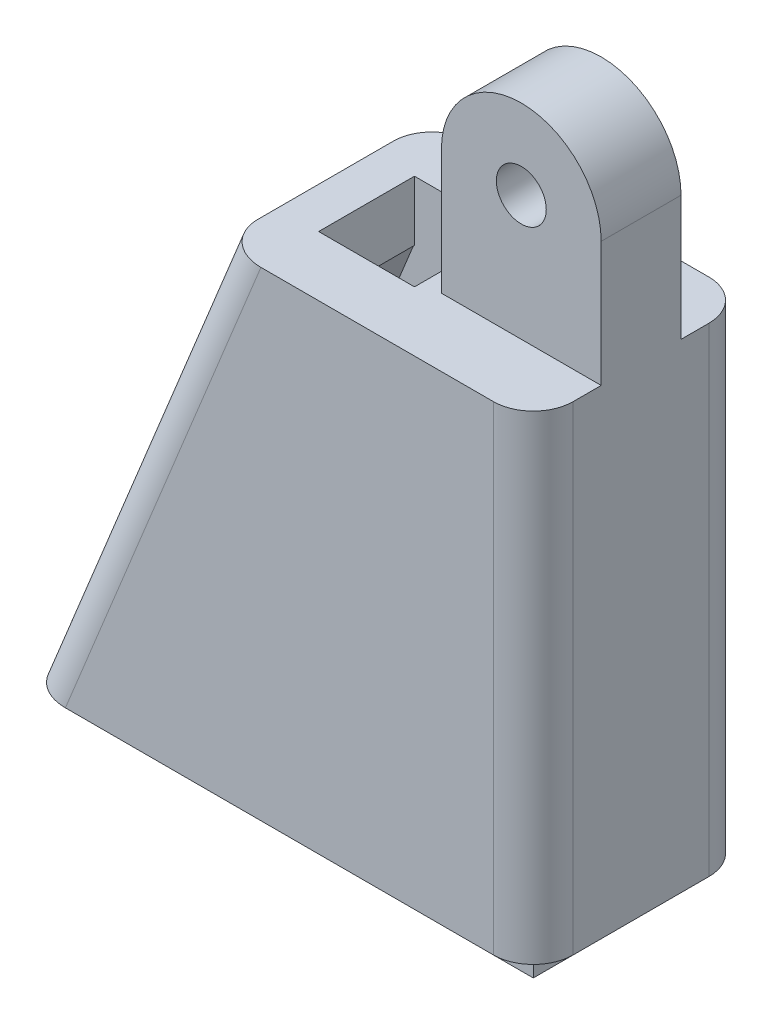
ISO-10303-21;
HEADER;
FILE_DESCRIPTION(('STEP AP214'),'2;1');
FILE_NAME('part.step','',(''),(''),'','','');
FILE_SCHEMA(('AUTOMOTIVE_DESIGN { 1 0 10303 214 1 1 1 1 }'));
ENDSEC;
DATA;
#1=APPLICATION_CONTEXT('core data for automotive mechanical design processes');
#2=APPLICATION_PROTOCOL_DEFINITION('international standard','automotive_design',2000,#1);
#3=PRODUCT_CONTEXT('',#1,'mechanical');
#4=PRODUCT('Part','Part','',(#3));
#5=PRODUCT_RELATED_PRODUCT_CATEGORY('part','',(#4));
#6=PRODUCT_DEFINITION_FORMATION('','',#4);
#7=PRODUCT_DEFINITION_CONTEXT('part definition',#1,'design');
#8=PRODUCT_DEFINITION('design','',#6,#7);
#9=PRODUCT_DEFINITION_SHAPE('','',#8);
#10=(LENGTH_UNIT() NAMED_UNIT(*) SI_UNIT(.MILLI.,.METRE.));
#11=(NAMED_UNIT(*) PLANE_ANGLE_UNIT() SI_UNIT($,.RADIAN.));
#12=(NAMED_UNIT(*) SI_UNIT($,.STERADIAN.) SOLID_ANGLE_UNIT());
#13=UNCERTAINTY_MEASURE_WITH_UNIT(LENGTH_MEASURE(1.E-05),#10,'distance_accuracy_value','');
#14=(GEOMETRIC_REPRESENTATION_CONTEXT(3) GLOBAL_UNCERTAINTY_ASSIGNED_CONTEXT((#13)) GLOBAL_UNIT_ASSIGNED_CONTEXT((#10,
#11,#12)) REPRESENTATION_CONTEXT('',''));
#15=CARTESIAN_POINT('',(0.,0.,0.));
#16=DIRECTION('',(0.,0.,1.));
#17=DIRECTION('',(1.,0.,0.));
#18=AXIS2_PLACEMENT_3D('',#15,#16,#17);
#19=CARTESIAN_POINT('',(0.,22.,0.));
#20=DIRECTION('',(0.,-1.,0.));
#21=DIRECTION('',(0.,0.,-1.));
#22=AXIS2_PLACEMENT_3D('',#19,#20,#21);
#23=PLANE('',#22);
#24=DIRECTION('',(0.,0.,1.));
#25=VECTOR('',#24,1.);
#26=CARTESIAN_POINT('',(4.04999999999998,22.,0.));
#27=LINE('',#26,#25);
#28=CARTESIAN_POINT('',(4.04999999999998,22.,-2.4));
#29=VERTEX_POINT('',#28);
#30=CARTESIAN_POINT('',(4.04999999999998,22.,2.4));
#31=VERTEX_POINT('',#30);
#32=EDGE_CURVE('E280',#29,#31,#27,.T.);
#33=ORIENTED_EDGE('',*,*,#32,.F.);
#34=DIRECTION('',(-1.,0.,0.));
#35=VECTOR('',#34,1.);
#36=CARTESIAN_POINT('',(0.,22.,-2.4));
#37=LINE('',#36,#35);
#38=CARTESIAN_POINT('',(9.99999999999998,22.,-2.4));
#39=VERTEX_POINT('',#38);
#40=EDGE_CURVE('E294',#39,#29,#37,.T.);
#41=ORIENTED_EDGE('',*,*,#40,.F.);
#42=DIRECTION('',(0.,0.,-1.));
#43=VECTOR('',#42,1.);
#44=CARTESIAN_POINT('',(9.99999999999998,22.,0.));
#45=LINE('',#44,#43);
#46=CARTESIAN_POINT('',(9.99999999999998,22.,2.4));
#47=VERTEX_POINT('',#46);
#48=EDGE_CURVE('E283',#47,#39,#45,.T.);
#49=ORIENTED_EDGE('',*,*,#48,.F.);
#50=DIRECTION('',(1.,0.,0.));
#51=VECTOR('',#50,1.);
#52=CARTESIAN_POINT('',(0.,22.,2.4));
#53=LINE('',#52,#51);
#54=EDGE_CURVE('E297',#31,#47,#53,.T.);
#55=ORIENTED_EDGE('',*,*,#54,.F.);
#56=EDGE_LOOP('',(#33,#41,#49,#55));
#57=FACE_BOUND('',#56,.T.);
#58=ADVANCED_FACE('F35',(#57),#23,.T.);
#59=CARTESIAN_POINT('',(0.,0.,0.));
#60=DIRECTION('',(0.,-1.,0.));
#61=DIRECTION('',(0.,0.,-1.));
#62=AXIS2_PLACEMENT_3D('',#59,#60,#61);
#63=PLANE('',#62);
#64=DIRECTION('',(1.,0.,0.));
#65=VECTOR('',#64,1.);
#66=CARTESIAN_POINT('',(-13.0001375,0.,4.4));
#67=LINE('',#66,#65);
#68=CARTESIAN_POINT('',(-10.,0.,4.4));
#69=VERTEX_POINT('',#68);
#70=CARTESIAN_POINT('',(12.,0.,4.4));
#71=VERTEX_POINT('',#70);
#72=EDGE_CURVE('E216',#69,#71,#67,.T.);
#73=ORIENTED_EDGE('',*,*,#72,.F.);
#74=CARTESIAN_POINT('',(-10.,0.,2.4));
#75=DIRECTION('',(0.,-1.,0.));
#76=DIRECTION('',(0.,0.,-1.));
#77=AXIS2_PLACEMENT_3D('',#74,#75,#76);
#78=CIRCLE('',#77,2.);
#79=CARTESIAN_POINT('',(-12.,0.,2.4));
#80=VERTEX_POINT('',#79);
#81=EDGE_CURVE('E435',#69,#80,#78,.T.);
#82=ORIENTED_EDGE('',*,*,#81,.T.);
#83=DIRECTION('',(0.,0.,-1.));
#84=VECTOR('',#83,1.);
#85=CARTESIAN_POINT('',(-12.,0.,4.85));
#86=LINE('',#85,#84);
#87=CARTESIAN_POINT('',(-12.,0.,-2.4));
#88=VERTEX_POINT('',#87);
#89=EDGE_CURVE('E237',#80,#88,#86,.T.);
#90=ORIENTED_EDGE('',*,*,#89,.T.);
#91=CARTESIAN_POINT('',(-10.,0.,-2.4));
#92=DIRECTION('',(0.,-1.,0.));
#93=DIRECTION('',(0.,0.,-1.));
#94=AXIS2_PLACEMENT_3D('',#91,#92,#93);
#95=CIRCLE('',#94,2.);
#96=CARTESIAN_POINT('',(-10.,0.,-4.4));
#97=VERTEX_POINT('',#96);
#98=EDGE_CURVE('E433',#88,#97,#95,.T.);
#99=ORIENTED_EDGE('',*,*,#98,.T.);
#100=DIRECTION('',(1.,0.,0.));
#101=VECTOR('',#100,1.);
#102=CARTESIAN_POINT('',(-13.0001375,0.,-4.4));
#103=LINE('',#102,#101);
#104=CARTESIAN_POINT('',(9.99999999999998,0.,-4.4));
#105=VERTEX_POINT('',#104);
#106=EDGE_CURVE('E245',#97,#105,#103,.T.);
#107=ORIENTED_EDGE('',*,*,#106,.T.);
#108=CARTESIAN_POINT('',(9.99999999999998,0.,-2.4));
#109=DIRECTION('',(0.,-1.,0.));
#110=DIRECTION('',(0.,0.,-1.));
#111=AXIS2_PLACEMENT_3D('',#108,#109,#110);
#112=CIRCLE('',#111,2.);
#113=CARTESIAN_POINT('',(12.,0.,-2.4));
#114=VERTEX_POINT('',#113);
#115=EDGE_CURVE('E236',#105,#114,#112,.T.);
#116=ORIENTED_EDGE('',*,*,#115,.T.);
#117=DIRECTION('',(0.,0.,-1.));
#118=VECTOR('',#117,1.);
#119=CARTESIAN_POINT('',(12.,0.,4.85));
#120=LINE('',#119,#118);
#121=EDGE_CURVE('E229',#71,#114,#120,.T.);
#122=ORIENTED_EDGE('',*,*,#121,.F.);
#123=EDGE_LOOP('',(#73,#82,#90,#99,#107,#116,#122));
#124=FACE_BOUND('',#123,.T.);
#125=DIRECTION('',(1.,0.,0.));
#126=VECTOR('',#125,1.);
#127=CARTESIAN_POINT('',(0.,0.,2.4));
#128=LINE('',#127,#126);
#129=CARTESIAN_POINT('',(-9.75991111233042,0.,2.4));
#130=VERTEX_POINT('',#129);
#131=CARTESIAN_POINT('',(9.99999999999998,0.,2.4));
#132=VERTEX_POINT('',#131);
#133=EDGE_CURVE('E286',#130,#132,#128,.T.);
#134=ORIENTED_EDGE('',*,*,#133,.T.);
#135=DIRECTION('',(0.,0.,-1.));
#136=VECTOR('',#135,1.);
#137=CARTESIAN_POINT('',(9.99999999999998,0.,0.));
#138=LINE('',#137,#136);
#139=CARTESIAN_POINT('',(9.99999999999998,0.,-2.4));
#140=VERTEX_POINT('',#139);
#141=EDGE_CURVE('E306',#132,#140,#138,.T.);
#142=ORIENTED_EDGE('',*,*,#141,.T.);
#143=DIRECTION('',(-1.,0.,0.));
#144=VECTOR('',#143,1.);
#145=CARTESIAN_POINT('',(0.,0.,-2.4));
#146=LINE('',#145,#144);
#147=CARTESIAN_POINT('',(-9.75991111233042,0.,-2.4));
#148=VERTEX_POINT('',#147);
#149=EDGE_CURVE('E310',#140,#148,#146,.T.);
#150=ORIENTED_EDGE('',*,*,#149,.T.);
#151=DIRECTION('',(0.,0.,1.));
#152=VECTOR('',#151,1.);
#153=CARTESIAN_POINT('',(-9.75991111233042,0.,0.));
#154=LINE('',#153,#152);
#155=EDGE_CURVE('E313',#148,#130,#154,.T.);
#156=ORIENTED_EDGE('',*,*,#155,.T.);
#157=EDGE_LOOP('',(#134,#142,#150,#156));
#158=FACE_BOUND('',#157,.T.);
#159=ADVANCED_FACE('F233',(#124,#158),#63,.T.);
#160=CARTESIAN_POINT('',(13.,25.,5.4));
#161=DIRECTION('',(-1.,0.,0.));
#162=DIRECTION('',(0.,0.,1.));
#163=AXIS2_PLACEMENT_3D('',#160,#161,#162);
#164=PLANE('',#163);
#165=DIRECTION('',(0.,0.,-1.));
#166=VECTOR('',#165,1.);
#167=CARTESIAN_POINT('',(13.,25.,5.4));
#168=LINE('',#167,#166);
#169=CARTESIAN_POINT('',(13.,25.,3.4));
#170=VERTEX_POINT('',#169);
#171=CARTESIAN_POINT('',(13.,25.,2.));
#172=VERTEX_POINT('',#171);
#173=EDGE_CURVE('E364',#170,#172,#168,.T.);
#174=ORIENTED_EDGE('',*,*,#173,.F.);
#175=DIRECTION('',(0.,-1.,0.));
#176=VECTOR('',#175,1.);
#177=CARTESIAN_POINT('',(13.,25.,3.4));
#178=LINE('',#177,#176);
#179=CARTESIAN_POINT('',(13.,1.,3.4));
#180=VERTEX_POINT('',#179);
#181=EDGE_CURVE('E397',#170,#180,#178,.T.);
#182=ORIENTED_EDGE('',*,*,#181,.T.);
#183=DIRECTION('',(0.,0.,1.));
#184=VECTOR('',#183,1.);
#185=CARTESIAN_POINT('',(13.,1.,5.4));
#186=LINE('',#185,#184);
#187=CARTESIAN_POINT('',(13.,1.,-3.4));
#188=VERTEX_POINT('',#187);
#189=EDGE_CURVE('E226',#188,#180,#186,.T.);
#190=ORIENTED_EDGE('',*,*,#189,.F.);
#191=DIRECTION('',(0.,-1.,0.));
#192=VECTOR('',#191,1.);
#193=CARTESIAN_POINT('',(13.,25.,-3.4));
#194=LINE('',#193,#192);
#195=CARTESIAN_POINT('',(13.,25.,-3.4));
#196=VERTEX_POINT('',#195);
#197=EDGE_CURVE('E362',#188,#196,#194,.F.);
#198=ORIENTED_EDGE('',*,*,#197,.T.);
#199=CARTESIAN_POINT('',(13.,25.,-2.));
#200=VERTEX_POINT('',#199);
#201=EDGE_CURVE('E357',#200,#196,#168,.T.);
#202=ORIENTED_EDGE('',*,*,#201,.F.);
#203=DIRECTION('',(0.,-1.,0.));
#204=VECTOR('',#203,1.);
#205=CARTESIAN_POINT('',(13.,35.25,-2.));
#206=LINE('',#205,#204);
#207=CARTESIAN_POINT('',(13.,31.25,-2.));
#208=VERTEX_POINT('',#207);
#209=EDGE_CURVE('E355',#208,#200,#206,.T.);
#210=ORIENTED_EDGE('',*,*,#209,.F.);
#211=DIRECTION('',(0.,0.,1.));
#212=VECTOR('',#211,1.);
#213=CARTESIAN_POINT('',(13.,31.25,-8.25));
#214=LINE('',#213,#212);
#215=CARTESIAN_POINT('',(13.,31.25,2.));
#216=VERTEX_POINT('',#215);
#217=EDGE_CURVE('E328',#208,#216,#214,.T.);
#218=ORIENTED_EDGE('',*,*,#217,.T.);
#219=DIRECTION('',(0.,-1.,0.));
#220=VECTOR('',#219,1.);
#221=CARTESIAN_POINT('',(13.,35.25,2.));
#222=LINE('',#221,#220);
#223=EDGE_CURVE('E348',#216,#172,#222,.T.);
#224=ORIENTED_EDGE('',*,*,#223,.T.);
#225=EDGE_LOOP('',(#174,#182,#190,#198,#202,#210,#218,#224));
#226=FACE_BOUND('',#225,.T.);
#227=ADVANCED_FACE('F392',(#226),#164,.F.);
#228=CARTESIAN_POINT('',(0.,25.,0.));
#229=DIRECTION('',(0.,-1.,0.));
#230=DIRECTION('',(0.,0.,-1.));
#231=AXIS2_PLACEMENT_3D('',#228,#229,#230);
#232=PLANE('',#231);
#233=DIRECTION('',(-1.,0.,0.));
#234=VECTOR('',#233,1.);
#235=CARTESIAN_POINT('',(4.04999999999998,25.,-2.4));
#236=LINE('',#235,#234);
#237=CARTESIAN_POINT('',(4.04999999999998,25.,-2.4));
#238=VERTEX_POINT('',#237);
#239=CARTESIAN_POINT('',(-0.75000000000002,25.,-2.4));
#240=VERTEX_POINT('',#239);
#241=EDGE_CURVE('E259',#238,#240,#236,.T.);
#242=ORIENTED_EDGE('',*,*,#241,.F.);
#243=DIRECTION('',(0.,0.,-1.));
#244=VECTOR('',#243,1.);
#245=CARTESIAN_POINT('',(4.04999999999998,25.,-2.4));
#246=LINE('',#245,#244);
#247=CARTESIAN_POINT('',(4.04999999999998,25.,2.4));
#248=VERTEX_POINT('',#247);
#249=EDGE_CURVE('E256',#248,#238,#246,.T.);
#250=ORIENTED_EDGE('',*,*,#249,.F.);
#251=DIRECTION('',(1.,0.,0.));
#252=VECTOR('',#251,1.);
#253=CARTESIAN_POINT('',(4.04999999999998,25.,2.4));
#254=LINE('',#253,#252);
#255=CARTESIAN_POINT('',(-0.750000000000018,25.,2.4));
#256=VERTEX_POINT('',#255);
#257=EDGE_CURVE('E265',#256,#248,#254,.T.);
#258=ORIENTED_EDGE('',*,*,#257,.F.);
#259=DIRECTION('',(0.,0.,1.));
#260=VECTOR('',#259,1.);
#261=CARTESIAN_POINT('',(-0.75000000000002,25.,-2.4));
#262=LINE('',#261,#260);
#263=EDGE_CURVE('E262',#240,#256,#262,.T.);
#264=ORIENTED_EDGE('',*,*,#263,.F.);
#265=EDGE_LOOP('',(#242,#250,#258,#264));
#266=FACE_BOUND('',#265,.T.);
#267=DIRECTION('',(1.,0.,0.));
#268=VECTOR('',#267,1.);
#269=CARTESIAN_POINT('',(-13.,25.,5.4));
#270=LINE('',#269,#268);
#271=CARTESIAN_POINT('',(-0.639940741553621,25.,5.4));
#272=VERTEX_POINT('',#271);
#273=CARTESIAN_POINT('',(11.,25.,5.4));
#274=VERTEX_POINT('',#273);
#275=EDGE_CURVE('E363',#272,#274,#270,.T.);
#276=ORIENTED_EDGE('',*,*,#275,.T.);
#277=CARTESIAN_POINT('',(11.,25.,3.4));
#278=DIRECTION('',(0.,-1.,0.));
#279=DIRECTION('',(0.,0.,-1.));
#280=AXIS2_PLACEMENT_3D('',#277,#278,#279);
#281=CIRCLE('',#280,2.);
#282=EDGE_CURVE('E418',#274,#170,#281,.F.);
#283=ORIENTED_EDGE('',*,*,#282,.T.);
#284=ORIENTED_EDGE('',*,*,#173,.T.);
#285=DIRECTION('',(1.,0.,0.));
#286=VECTOR('',#285,1.);
#287=CARTESIAN_POINT('',(13.,25.,2.));
#288=LINE('',#287,#286);
#289=CARTESIAN_POINT('',(4.99999999999998,25.,2.));
#290=VERTEX_POINT('',#289);
#291=EDGE_CURVE('E339',#290,#172,#288,.T.);
#292=ORIENTED_EDGE('',*,*,#291,.F.);
#293=DIRECTION('',(0.,0.,1.));
#294=VECTOR('',#293,1.);
#295=CARTESIAN_POINT('',(4.99999999999998,25.,-2.));
#296=LINE('',#295,#294);
#297=CARTESIAN_POINT('',(4.99999999999998,25.,-2.));
#298=VERTEX_POINT('',#297);
#299=EDGE_CURVE('E336',#298,#290,#296,.T.);
#300=ORIENTED_EDGE('',*,*,#299,.F.);
#301=DIRECTION('',(-1.,0.,0.));
#302=VECTOR('',#301,1.);
#303=CARTESIAN_POINT('',(13.,25.,-2.));
#304=LINE('',#303,#302);
#305=EDGE_CURVE('E335',#200,#298,#304,.T.);
#306=ORIENTED_EDGE('',*,*,#305,.F.);
#307=ORIENTED_EDGE('',*,*,#201,.T.);
#308=CARTESIAN_POINT('',(11.,25.,-3.4));
#309=DIRECTION('',(0.,-1.,0.));
#310=DIRECTION('',(0.,0.,-1.));
#311=AXIS2_PLACEMENT_3D('',#308,#309,#310);
#312=CIRCLE('',#311,2.);
#313=CARTESIAN_POINT('',(11.,25.,-5.4));
#314=VERTEX_POINT('',#313);
#315=EDGE_CURVE('E412',#196,#314,#312,.F.);
#316=ORIENTED_EDGE('',*,*,#315,.T.);
#317=DIRECTION('',(-1.,0.,0.));
#318=VECTOR('',#317,1.);
#319=CARTESIAN_POINT('',(-13.,25.,-5.4));
#320=LINE('',#319,#318);
#321=CARTESIAN_POINT('',(-0.639940741553623,25.,-5.4));
#322=VERTEX_POINT('',#321);
#323=EDGE_CURVE('E367',#314,#322,#320,.T.);
#324=ORIENTED_EDGE('',*,*,#323,.T.);
#325=CARTESIAN_POINT('',(-0.639940741553622,25.,-3.4));
#326=DIRECTION('',(0.,-1.,0.));
#327=DIRECTION('',(1.,0.,0.));
#328=AXIS2_PLACEMENT_3D('',#325,#326,#327);
#329=ELLIPSE('',#328,2.1600592584464,2.);
#330=CARTESIAN_POINT('',(-2.80000000000002,25.,-3.4));
#331=VERTEX_POINT('',#330);
#332=EDGE_CURVE('E414',#322,#331,#329,.F.);
#333=ORIENTED_EDGE('',*,*,#332,.T.);
#334=DIRECTION('',(0.,0.,1.));
#335=VECTOR('',#334,1.);
#336=CARTESIAN_POINT('',(-2.80000000000002,25.,-5.400025));
#337=LINE('',#336,#335);
#338=CARTESIAN_POINT('',(-2.80000000000002,25.,3.4));
#339=VERTEX_POINT('',#338);
#340=EDGE_CURVE('E293',#331,#339,#337,.T.);
#341=ORIENTED_EDGE('',*,*,#340,.T.);
#342=CARTESIAN_POINT('',(-0.639940741553623,25.,3.4));
#343=DIRECTION('',(0.,-1.,0.));
#344=DIRECTION('',(1.,0.,0.));
#345=AXIS2_PLACEMENT_3D('',#342,#343,#344);
#346=ELLIPSE('',#345,2.1600592584464,2.);
#347=EDGE_CURVE('E416',#339,#272,#346,.F.);
#348=ORIENTED_EDGE('',*,*,#347,.T.);
#349=EDGE_LOOP('',(#276,#283,#284,#292,#300,#306,#307,#316,#324,#333,#341,#348));
#350=FACE_BOUND('',#349,.T.);
#351=ADVANCED_FACE('F387',(#266,#350),#232,.F.);
#352=CARTESIAN_POINT('',(-13.,25.,-5.4));
#353=DIRECTION('',(0.,0.,1.));
#354=DIRECTION('',(1.,0.,0.));
#355=AXIS2_PLACEMENT_3D('',#352,#353,#354);
#356=PLANE('',#355);
#357=DIRECTION('',(1.,0.,0.));
#358=VECTOR('',#357,1.);
#359=CARTESIAN_POINT('',(-13.0001375,1.,-5.4));
#360=LINE('',#359,#358);
#361=CARTESIAN_POINT('',(-10.4319407415536,1.,-5.4));
#362=VERTEX_POINT('',#361);
#363=CARTESIAN_POINT('',(11.,1.,-5.4));
#364=VERTEX_POINT('',#363);
#365=EDGE_CURVE('E231',#362,#364,#360,.T.);
#366=ORIENTED_EDGE('',*,*,#365,.F.);
#367=DIRECTION('',(0.377767413930533,0.925900524339542,0.));
#368=VECTOR('',#367,1.);
#369=CARTESIAN_POINT('',(-2.40382278540411,20.6767596964449,-5.4));
#370=LINE('',#369,#368);
#371=EDGE_CURVE('E428',#362,#322,#370,.T.);
#372=ORIENTED_EDGE('',*,*,#371,.T.);
#373=ORIENTED_EDGE('',*,*,#323,.F.);
#374=DIRECTION('',(0.,-1.,0.));
#375=VECTOR('',#374,1.);
#376=CARTESIAN_POINT('',(11.,25.,-5.4));
#377=LINE('',#376,#375);
#378=EDGE_CURVE('E425',#314,#364,#377,.T.);
#379=ORIENTED_EDGE('',*,*,#378,.T.);
#380=EDGE_LOOP('',(#366,#372,#373,#379));
#381=FACE_BOUND('',#380,.T.);
#382=ADVANCED_FACE('F746',(#381),#356,.F.);
#383=CARTESIAN_POINT('',(-13.,25.,5.4));
#384=DIRECTION('',(0.,0.,-1.));
#385=DIRECTION('',(-1.,0.,0.));
#386=AXIS2_PLACEMENT_3D('',#383,#384,#385);
#387=PLANE('',#386);
#388=DIRECTION('',(1.,0.,0.));
#389=VECTOR('',#388,1.);
#390=CARTESIAN_POINT('',(-13.0001375,1.,5.4));
#391=LINE('',#390,#389);
#392=CARTESIAN_POINT('',(-10.4319407415536,1.,5.4));
#393=VERTEX_POINT('',#392);
#394=CARTESIAN_POINT('',(11.,1.,5.4));
#395=VERTEX_POINT('',#394);
#396=EDGE_CURVE('E253',#393,#395,#391,.T.);
#397=ORIENTED_EDGE('',*,*,#396,.T.);
#398=DIRECTION('',(0.,-1.,0.));
#399=VECTOR('',#398,1.);
#400=CARTESIAN_POINT('',(11.,25.,5.4));
#401=LINE('',#400,#399);
#402=EDGE_CURVE('E410',#395,#274,#401,.F.);
#403=ORIENTED_EDGE('',*,*,#402,.T.);
#404=ORIENTED_EDGE('',*,*,#275,.F.);
#405=DIRECTION('',(0.377767413930533,0.925900524339542,0.));
#406=VECTOR('',#405,1.);
#407=CARTESIAN_POINT('',(-2.40382278540411,20.6767596964449,5.4));
#408=LINE('',#407,#406);
#409=EDGE_CURVE('E408',#272,#393,#408,.F.);
#410=ORIENTED_EDGE('',*,*,#409,.T.);
#411=EDGE_LOOP('',(#397,#403,#404,#410));
#412=FACE_BOUND('',#411,.T.);
#413=ADVANCED_FACE('F735',(#412),#387,.F.);
#414=CARTESIAN_POINT('',(13.,35.25,-2.));
#415=DIRECTION('',(0.,0.,1.));
#416=DIRECTION('',(1.,0.,0.));
#417=AXIS2_PLACEMENT_3D('',#414,#415,#416);
#418=PLANE('',#417);
#419=CARTESIAN_POINT('',(8.99999999999998,31.25,-2.));
#420=DIRECTION('',(0.,0.,1.));
#421=DIRECTION('',(1.,0.,0.));
#422=AXIS2_PLACEMENT_3D('',#419,#420,#421);
#423=CIRCLE('',#422,1.25);
#424=CARTESIAN_POINT('',(10.25,31.25,-2.));
#425=VERTEX_POINT('',#424);
#426=EDGE_CURVE('E323',#425,#425,#423,.T.);
#427=ORIENTED_EDGE('',*,*,#426,.T.);
#428=EDGE_LOOP('',(#427));
#429=FACE_BOUND('',#428,.T.);
#430=DIRECTION('',(0.,-1.,0.));
#431=VECTOR('',#430,1.);
#432=CARTESIAN_POINT('',(4.99999999999998,35.25,-2.));
#433=LINE('',#432,#431);
#434=CARTESIAN_POINT('',(4.99999999999998,31.25,-2.));
#435=VERTEX_POINT('',#434);
#436=EDGE_CURVE('E358',#435,#298,#433,.T.);
#437=ORIENTED_EDGE('',*,*,#436,.F.);
#438=CARTESIAN_POINT('',(8.99999999999998,31.25,-2.));
#439=DIRECTION('',(0.,0.,1.));
#440=DIRECTION('',(1.,0.,0.));
#441=AXIS2_PLACEMENT_3D('',#438,#439,#440);
#442=CIRCLE('',#441,4.);
#443=EDGE_CURVE('E331',#435,#208,#442,.F.);
#444=ORIENTED_EDGE('',*,*,#443,.T.);
#445=ORIENTED_EDGE('',*,*,#209,.T.);
#446=ORIENTED_EDGE('',*,*,#305,.T.);
#447=EDGE_LOOP('',(#437,#444,#445,#446));
#448=FACE_BOUND('',#447,.T.);
#449=ADVANCED_FACE('F381',(#429,#448),#418,.F.);
#450=CARTESIAN_POINT('',(4.99999999999998,35.25,-2.));
#451=DIRECTION('',(1.,0.,0.));
#452=DIRECTION('',(0.,0.,-1.));
#453=AXIS2_PLACEMENT_3D('',#450,#451,#452);
#454=PLANE('',#453);
#455=DIRECTION('',(0.,-1.,0.));
#456=VECTOR('',#455,1.);
#457=CARTESIAN_POINT('',(4.99999999999998,35.25,2.));
#458=LINE('',#457,#456);
#459=CARTESIAN_POINT('',(4.99999999999998,31.25,2.));
#460=VERTEX_POINT('',#459);
#461=EDGE_CURVE('E342',#460,#290,#458,.T.);
#462=ORIENTED_EDGE('',*,*,#461,.F.);
#463=DIRECTION('',(0.,0.,1.));
#464=VECTOR('',#463,1.);
#465=CARTESIAN_POINT('',(4.99999999999998,31.25,-8.25));
#466=LINE('',#465,#464);
#467=EDGE_CURVE('E329',#435,#460,#466,.T.);
#468=ORIENTED_EDGE('',*,*,#467,.F.);
#469=ORIENTED_EDGE('',*,*,#436,.T.);
#470=ORIENTED_EDGE('',*,*,#299,.T.);
#471=EDGE_LOOP('',(#462,#468,#469,#470));
#472=FACE_BOUND('',#471,.T.);
#473=ADVANCED_FACE('F716',(#472),#454,.F.);
#474=CARTESIAN_POINT('',(13.,35.25,2.));
#475=DIRECTION('',(0.,0.,-1.));
#476=DIRECTION('',(-1.,0.,0.));
#477=AXIS2_PLACEMENT_3D('',#474,#475,#476);
#478=PLANE('',#477);
#479=CARTESIAN_POINT('',(8.99999999999998,31.25,2.));
#480=DIRECTION('',(0.,0.,1.));
#481=DIRECTION('',(1.,0.,0.));
#482=AXIS2_PLACEMENT_3D('',#479,#480,#481);
#483=CIRCLE('',#482,1.25);
#484=CARTESIAN_POINT('',(10.25,31.25,2.));
#485=VERTEX_POINT('',#484);
#486=EDGE_CURVE('E320',#485,#485,#483,.T.);
#487=ORIENTED_EDGE('',*,*,#486,.F.);
#488=EDGE_LOOP('',(#487));
#489=FACE_BOUND('',#488,.T.);
#490=ORIENTED_EDGE('',*,*,#223,.F.);
#491=CARTESIAN_POINT('',(8.99999999999998,31.25,2.));
#492=DIRECTION('',(0.,0.,-1.));
#493=DIRECTION('',(-1.,0.,0.));
#494=AXIS2_PLACEMENT_3D('',#491,#492,#493);
#495=CIRCLE('',#494,4.);
#496=EDGE_CURVE('E326',#460,#216,#495,.T.);
#497=ORIENTED_EDGE('',*,*,#496,.F.);
#498=ORIENTED_EDGE('',*,*,#461,.T.);
#499=ORIENTED_EDGE('',*,*,#291,.T.);
#500=EDGE_LOOP('',(#490,#497,#498,#499));
#501=FACE_BOUND('',#500,.T.);
#502=ADVANCED_FACE('F705',(#489,#501),#478,.F.);
#503=CARTESIAN_POINT('',(8.99999999999998,31.25,-8.25));
#504=DIRECTION('',(0.,0.,1.));
#505=DIRECTION('',(1.,0.,0.));
#506=AXIS2_PLACEMENT_3D('',#503,#504,#505);
#507=CYLINDRICAL_SURFACE('',#506,4.);
#508=ORIENTED_EDGE('',*,*,#467,.T.);
#509=ORIENTED_EDGE('',*,*,#496,.T.);
#510=ORIENTED_EDGE('',*,*,#217,.F.);
#511=ORIENTED_EDGE('',*,*,#443,.F.);
#512=EDGE_LOOP('',(#508,#509,#510,#511));
#513=FACE_BOUND('',#512,.T.);
#514=ADVANCED_FACE('F694',(#513),#507,.T.);
#515=CARTESIAN_POINT('',(8.99999999999998,31.25,-8.25));
#516=DIRECTION('',(0.,0.,1.));
#517=DIRECTION('',(1.,0.,0.));
#518=AXIS2_PLACEMENT_3D('',#515,#516,#517);
#519=CYLINDRICAL_SURFACE('',#518,1.25);
#520=ORIENTED_EDGE('',*,*,#486,.T.);
#521=EDGE_LOOP('',(#520));
#522=FACE_BOUND('',#521,.T.);
#523=ORIENTED_EDGE('',*,*,#426,.F.);
#524=EDGE_LOOP('',(#523));
#525=FACE_BOUND('',#524,.T.);
#526=ADVANCED_FACE('F689',(#522,#525),#519,.F.);
#527=CARTESIAN_POINT('',(-13.,0.,-5.400025));
#528=DIRECTION('',(0.925900524339541,-0.377767413930533,0.));
#529=DIRECTION('',(0.377767413930533,0.925900524339542,0.));
#530=AXIS2_PLACEMENT_3D('',#527,#528,#529);
#531=PLANE('',#530);
#532=DIRECTION('',(0.,0.,1.));
#533=VECTOR('',#532,1.);
#534=CARTESIAN_POINT('',(-12.592,1.,-5.400025));
#535=LINE('',#534,#533);
#536=CARTESIAN_POINT('',(-12.592,1.,-3.4));
#537=VERTEX_POINT('',#536);
#538=CARTESIAN_POINT('',(-12.592,1.,3.4));
#539=VERTEX_POINT('',#538);
#540=EDGE_CURVE('E359',#537,#539,#535,.T.);
#541=ORIENTED_EDGE('',*,*,#540,.T.);
#542=DIRECTION('',(0.377767413930533,0.925900524339542,0.));
#543=VECTOR('',#542,1.);
#544=CARTESIAN_POINT('',(-13.,0.,3.4));
#545=LINE('',#544,#543);
#546=EDGE_CURVE('E422',#539,#339,#545,.T.);
#547=ORIENTED_EDGE('',*,*,#546,.T.);
#548=ORIENTED_EDGE('',*,*,#340,.F.);
#549=DIRECTION('',(0.377767413930533,0.925900524339542,0.));
#550=VECTOR('',#549,1.);
#551=CARTESIAN_POINT('',(-13.,0.,-3.4));
#552=LINE('',#551,#550);
#553=EDGE_CURVE('E420',#331,#537,#552,.F.);
#554=ORIENTED_EDGE('',*,*,#553,.T.);
#555=EDGE_LOOP('',(#541,#547,#548,#554));
#556=FACE_BOUND('',#555,.T.);
#557=ADVANCED_FACE('F494',(#556),#531,.F.);
#558=CARTESIAN_POINT('',(9.99999999999998,25.,5.4));
#559=DIRECTION('',(-1.,0.,0.));
#560=DIRECTION('',(0.,0.,1.));
#561=AXIS2_PLACEMENT_3D('',#558,#559,#560);
#562=PLANE('',#561);
#563=DIRECTION('',(0.,-1.,0.));
#564=VECTOR('',#563,1.);
#565=CARTESIAN_POINT('',(9.99999999999998,25.,-2.4));
#566=LINE('',#565,#564);
#567=EDGE_CURVE('E289',#39,#140,#566,.T.);
#568=ORIENTED_EDGE('',*,*,#567,.T.);
#569=ORIENTED_EDGE('',*,*,#141,.F.);
#570=DIRECTION('',(0.,-1.,0.));
#571=VECTOR('',#570,1.);
#572=CARTESIAN_POINT('',(9.99999999999998,25.,2.4));
#573=LINE('',#572,#571);
#574=EDGE_CURVE('E287',#47,#132,#573,.T.);
#575=ORIENTED_EDGE('',*,*,#574,.F.);
#576=ORIENTED_EDGE('',*,*,#48,.T.);
#577=EDGE_LOOP('',(#568,#569,#575,#576));
#578=FACE_BOUND('',#577,.T.);
#579=ADVANCED_FACE('F486',(#578),#562,.T.);
#580=DIRECTION('',(0.,0.,-1.));
#581=VECTOR('',#580,1.);
#582=CARTESIAN_POINT('',(-0.750000000000019,22.,0.));
#583=LINE('',#582,#581);
#584=CARTESIAN_POINT('',(-0.750000000000018,22.,2.4));
#585=VERTEX_POINT('',#584);
#586=CARTESIAN_POINT('',(-0.75000000000002,22.,-2.4));
#587=VERTEX_POINT('',#586);
#588=EDGE_CURVE('E271',#585,#587,#583,.T.);
#589=ORIENTED_EDGE('',*,*,#588,.F.);
#590=CARTESIAN_POINT('',(-0.783911112330423,22.,2.4));
#591=VERTEX_POINT('',#590);
#592=EDGE_CURVE('E290',#591,#585,#53,.T.);
#593=ORIENTED_EDGE('',*,*,#592,.F.);
#594=DIRECTION('',(0.,0.,1.));
#595=VECTOR('',#594,1.);
#596=CARTESIAN_POINT('',(-0.783911112330424,22.,0.));
#597=LINE('',#596,#595);
#598=CARTESIAN_POINT('',(-0.783911112330423,22.,-2.4));
#599=VERTEX_POINT('',#598);
#600=EDGE_CURVE('E298',#599,#591,#597,.T.);
#601=ORIENTED_EDGE('',*,*,#600,.F.);
#602=EDGE_CURVE('E285',#587,#599,#37,.T.);
#603=ORIENTED_EDGE('',*,*,#602,.F.);
#604=EDGE_LOOP('',(#589,#593,#601,#603));
#605=FACE_BOUND('',#604,.T.);
#606=ADVANCED_FACE('F476',(#605),#23,.T.);
#607=CARTESIAN_POINT('',(-13.,25.,-2.4));
#608=DIRECTION('',(0.,0.,1.));
#609=DIRECTION('',(1.,0.,0.));
#610=AXIS2_PLACEMENT_3D('',#607,#608,#609);
#611=PLANE('',#610);
#612=ORIENTED_EDGE('',*,*,#40,.T.);
#613=DIRECTION('',(0.,1.,0.));
#614=VECTOR('',#613,1.);
#615=CARTESIAN_POINT('',(4.04999999999998,14.75,-2.4));
#616=LINE('',#615,#614);
#617=EDGE_CURVE('E268',#29,#238,#616,.T.);
#618=ORIENTED_EDGE('',*,*,#617,.T.);
#619=ORIENTED_EDGE('',*,*,#241,.T.);
#620=DIRECTION('',(0.,1.,0.));
#621=VECTOR('',#620,1.);
#622=CARTESIAN_POINT('',(-0.75000000000002,14.75,-2.4));
#623=LINE('',#622,#621);
#624=EDGE_CURVE('E274',#587,#240,#623,.T.);
#625=ORIENTED_EDGE('',*,*,#624,.F.);
#626=ORIENTED_EDGE('',*,*,#602,.T.);
#627=DIRECTION('',(0.377767413930533,0.925900524339542,0.));
#628=VECTOR('',#627,1.);
#629=CARTESIAN_POINT('',(-1.47792226106457,20.2989922825143,-2.4));
#630=LINE('',#629,#628);
#631=EDGE_CURVE('E301',#148,#599,#630,.T.);
#632=ORIENTED_EDGE('',*,*,#631,.F.);
#633=ORIENTED_EDGE('',*,*,#149,.F.);
#634=ORIENTED_EDGE('',*,*,#567,.F.);
#635=EDGE_LOOP('',(#612,#618,#619,#625,#626,#632,#633,#634));
#636=FACE_BOUND('',#635,.T.);
#637=ADVANCED_FACE('F485',(#636),#611,.T.);
#638=CARTESIAN_POINT('',(-13.,25.,2.4));
#639=DIRECTION('',(0.,0.,-1.));
#640=DIRECTION('',(-1.,0.,0.));
#641=AXIS2_PLACEMENT_3D('',#638,#639,#640);
#642=PLANE('',#641);
#643=ORIENTED_EDGE('',*,*,#592,.T.);
#644=DIRECTION('',(0.,1.,0.));
#645=VECTOR('',#644,1.);
#646=CARTESIAN_POINT('',(-0.750000000000018,14.75,2.4));
#647=LINE('',#646,#645);
#648=EDGE_CURVE('E272',#585,#256,#647,.T.);
#649=ORIENTED_EDGE('',*,*,#648,.T.);
#650=ORIENTED_EDGE('',*,*,#257,.T.);
#651=DIRECTION('',(0.,1.,0.));
#652=VECTOR('',#651,1.);
#653=CARTESIAN_POINT('',(4.04999999999998,14.75,2.4));
#654=LINE('',#653,#652);
#655=EDGE_CURVE('E269',#31,#248,#654,.T.);
#656=ORIENTED_EDGE('',*,*,#655,.F.);
#657=ORIENTED_EDGE('',*,*,#54,.T.);
#658=ORIENTED_EDGE('',*,*,#574,.T.);
#659=ORIENTED_EDGE('',*,*,#133,.F.);
#660=DIRECTION('',(0.377767413930533,0.925900524339542,0.));
#661=VECTOR('',#660,1.);
#662=CARTESIAN_POINT('',(-10.2222984269814,-1.1333022417916,2.4));
#663=LINE('',#662,#661);
#664=EDGE_CURVE('E282',#130,#591,#663,.T.);
#665=ORIENTED_EDGE('',*,*,#664,.T.);
#666=EDGE_LOOP('',(#643,#649,#650,#656,#657,#658,#659,#665));
#667=FACE_BOUND('',#666,.T.);
#668=ADVANCED_FACE('F492',(#667),#642,.T.);
#669=CARTESIAN_POINT('',(-10.2222984269814,-1.1333022417916,-5.400025));
#670=DIRECTION('',(0.925900524339541,-0.377767413930533,0.));
#671=DIRECTION('',(0.377767413930533,0.925900524339542,0.));
#672=AXIS2_PLACEMENT_3D('',#669,#670,#671);
#673=PLANE('',#672);
#674=ORIENTED_EDGE('',*,*,#155,.F.);
#675=ORIENTED_EDGE('',*,*,#631,.T.);
#676=ORIENTED_EDGE('',*,*,#600,.T.);
#677=ORIENTED_EDGE('',*,*,#664,.F.);
#678=EDGE_LOOP('',(#674,#675,#676,#677));
#679=FACE_BOUND('',#678,.T.);
#680=ADVANCED_FACE('F504',(#679),#673,.T.);
#681=CARTESIAN_POINT('',(4.04999999999998,14.75,-2.4));
#682=DIRECTION('',(1.,0.,0.));
#683=DIRECTION('',(0.,0.,-1.));
#684=AXIS2_PLACEMENT_3D('',#681,#682,#683);
#685=PLANE('',#684);
#686=ORIENTED_EDGE('',*,*,#32,.T.);
#687=ORIENTED_EDGE('',*,*,#655,.T.);
#688=ORIENTED_EDGE('',*,*,#249,.T.);
#689=ORIENTED_EDGE('',*,*,#617,.F.);
#690=EDGE_LOOP('',(#686,#687,#688,#689));
#691=FACE_BOUND('',#690,.T.);
#692=ADVANCED_FACE('F515',(#691),#685,.F.);
#693=CARTESIAN_POINT('',(-0.75000000000002,14.75,-2.4));
#694=DIRECTION('',(-1.,0.,0.));
#695=DIRECTION('',(0.,0.,1.));
#696=AXIS2_PLACEMENT_3D('',#693,#694,#695);
#697=PLANE('',#696);
#698=ORIENTED_EDGE('',*,*,#588,.T.);
#699=ORIENTED_EDGE('',*,*,#624,.T.);
#700=ORIENTED_EDGE('',*,*,#263,.T.);
#701=ORIENTED_EDGE('',*,*,#648,.F.);
#702=EDGE_LOOP('',(#698,#699,#700,#701));
#703=FACE_BOUND('',#702,.T.);
#704=ADVANCED_FACE('F520',(#703),#697,.F.);
#705=CARTESIAN_POINT('',(-13.0001375,1.,5.4));
#706=DIRECTION('',(0.,1.,0.));
#707=DIRECTION('',(0.,0.,1.));
#708=AXIS2_PLACEMENT_3D('',#705,#706,#707);
#709=PLANE('',#708);
#710=DIRECTION('',(0.,0.,-1.));
#711=VECTOR('',#710,1.);
#712=CARTESIAN_POINT('',(-12.,1.,4.85));
#713=LINE('',#712,#711);
#714=CARTESIAN_POINT('',(-12.,1.,2.4));
#715=VERTEX_POINT('',#714);
#716=CARTESIAN_POINT('',(-12.,1.,-2.4));
#717=VERTEX_POINT('',#716);
#718=EDGE_CURVE('E241',#715,#717,#713,.T.);
#719=ORIENTED_EDGE('',*,*,#718,.F.);
#720=CARTESIAN_POINT('',(-10.,1.,2.4));
#721=DIRECTION('',(0.,1.,0.));
#722=DIRECTION('',(0.,0.,1.));
#723=AXIS2_PLACEMENT_3D('',#720,#721,#722);
#724=CIRCLE('',#723,2.);
#725=CARTESIAN_POINT('',(-10.,1.,4.4));
#726=VERTEX_POINT('',#725);
#727=EDGE_CURVE('E448',#715,#726,#724,.T.);
#728=ORIENTED_EDGE('',*,*,#727,.T.);
#729=DIRECTION('',(1.,0.,0.));
#730=VECTOR('',#729,1.);
#731=CARTESIAN_POINT('',(-13.0001375,1.,4.4));
#732=LINE('',#731,#730);
#733=CARTESIAN_POINT('',(12.,1.,4.4));
#734=VERTEX_POINT('',#733);
#735=EDGE_CURVE('E225',#726,#734,#732,.T.);
#736=ORIENTED_EDGE('',*,*,#735,.T.);
#737=DIRECTION('',(0.,0.,-1.));
#738=VECTOR('',#737,1.);
#739=CARTESIAN_POINT('',(12.,1.,4.85));
#740=LINE('',#739,#738);
#741=CARTESIAN_POINT('',(12.,1.,-2.4));
#742=VERTEX_POINT('',#741);
#743=EDGE_CURVE('E230',#734,#742,#740,.T.);
#744=ORIENTED_EDGE('',*,*,#743,.T.);
#745=CARTESIAN_POINT('',(9.99999999999998,1.,-2.4));
#746=DIRECTION('',(0.,1.,0.));
#747=DIRECTION('',(0.,0.,1.));
#748=AXIS2_PLACEMENT_3D('',#745,#746,#747);
#749=CIRCLE('',#748,2.);
#750=CARTESIAN_POINT('',(9.99999999999998,1.,-4.4));
#751=VERTEX_POINT('',#750);
#752=EDGE_CURVE('E11',#742,#751,#749,.T.);
#753=ORIENTED_EDGE('',*,*,#752,.T.);
#754=DIRECTION('',(1.,0.,0.));
#755=VECTOR('',#754,1.);
#756=CARTESIAN_POINT('',(-13.0001375,1.,-4.4));
#757=LINE('',#756,#755);
#758=CARTESIAN_POINT('',(-10.,1.,-4.4));
#759=VERTEX_POINT('',#758);
#760=EDGE_CURVE('E247',#759,#751,#757,.T.);
#761=ORIENTED_EDGE('',*,*,#760,.F.);
#762=CARTESIAN_POINT('',(-10.,1.,-2.4));
#763=DIRECTION('',(0.,1.,0.));
#764=DIRECTION('',(0.,0.,1.));
#765=AXIS2_PLACEMENT_3D('',#762,#763,#764);
#766=CIRCLE('',#765,2.);
#767=EDGE_CURVE('E43',#759,#717,#766,.T.);
#768=ORIENTED_EDGE('',*,*,#767,.T.);
#769=EDGE_LOOP('',(#719,#728,#736,#744,#753,#761,#768));
#770=FACE_BOUND('',#769,.T.);
#771=ORIENTED_EDGE('',*,*,#189,.T.);
#772=CARTESIAN_POINT('',(11.,1.,3.4));
#773=DIRECTION('',(0.,1.,0.));
#774=DIRECTION('',(0.,0.,1.));
#775=AXIS2_PLACEMENT_3D('',#772,#773,#774);
#776=CIRCLE('',#775,2.);
#777=EDGE_CURVE('E406',#180,#395,#776,.F.);
#778=ORIENTED_EDGE('',*,*,#777,.T.);
#779=ORIENTED_EDGE('',*,*,#396,.F.);
#780=CARTESIAN_POINT('',(-10.4319407415536,1.,3.4));
#781=DIRECTION('',(0.,1.,0.));
#782=DIRECTION('',(1.,0.,0.));
#783=AXIS2_PLACEMENT_3D('',#780,#781,#782);
#784=ELLIPSE('',#783,2.1600592584464,2.);
#785=EDGE_CURVE('E404',#393,#539,#784,.F.);
#786=ORIENTED_EDGE('',*,*,#785,.T.);
#787=ORIENTED_EDGE('',*,*,#540,.F.);
#788=CARTESIAN_POINT('',(-10.4319407415536,1.,-3.4));
#789=DIRECTION('',(0.,1.,0.));
#790=DIRECTION('',(1.,0.,0.));
#791=AXIS2_PLACEMENT_3D('',#788,#789,#790);
#792=ELLIPSE('',#791,2.1600592584464,2.);
#793=EDGE_CURVE('E400',#537,#362,#792,.F.);
#794=ORIENTED_EDGE('',*,*,#793,.T.);
#795=ORIENTED_EDGE('',*,*,#365,.T.);
#796=CARTESIAN_POINT('',(11.,1.,-3.4));
#797=DIRECTION('',(0.,1.,0.));
#798=DIRECTION('',(0.,0.,1.));
#799=AXIS2_PLACEMENT_3D('',#796,#797,#798);
#800=CIRCLE('',#799,2.);
#801=EDGE_CURVE('E398',#364,#188,#800,.F.);
#802=ORIENTED_EDGE('',*,*,#801,.T.);
#803=EDGE_LOOP('',(#771,#778,#779,#786,#787,#794,#795,#802));
#804=FACE_BOUND('',#803,.T.);
#805=ADVANCED_FACE('F451',(#770,#804),#709,.F.);
#806=CARTESIAN_POINT('',(-13.0001375,0.,4.4));
#807=DIRECTION('',(0.,0.,-1.));
#808=DIRECTION('',(-1.,0.,0.));
#809=AXIS2_PLACEMENT_3D('',#806,#807,#808);
#810=PLANE('',#809);
#811=ORIENTED_EDGE('',*,*,#735,.F.);
#812=DIRECTION('',(0.,-1.,0.));
#813=VECTOR('',#812,1.);
#814=CARTESIAN_POINT('',(-10.,0.,4.4));
#815=LINE('',#814,#813);
#816=EDGE_CURVE('E222',#726,#69,#815,.T.);
#817=ORIENTED_EDGE('',*,*,#816,.T.);
#818=ORIENTED_EDGE('',*,*,#72,.T.);
#819=DIRECTION('',(0.,1.,0.));
#820=VECTOR('',#819,1.);
#821=CARTESIAN_POINT('',(12.,0.,4.4));
#822=LINE('',#821,#820);
#823=EDGE_CURVE('E220',#71,#734,#822,.T.);
#824=ORIENTED_EDGE('',*,*,#823,.T.);
#825=EDGE_LOOP('',(#811,#817,#818,#824));
#826=FACE_BOUND('',#825,.T.);
#827=ADVANCED_FACE('F219',(#826),#810,.F.);
#828=CARTESIAN_POINT('',(-13.0001375,0.,-4.4));
#829=DIRECTION('',(0.,0.,1.));
#830=DIRECTION('',(1.,0.,0.));
#831=AXIS2_PLACEMENT_3D('',#828,#829,#830);
#832=PLANE('',#831);
#833=ORIENTED_EDGE('',*,*,#106,.F.);
#834=DIRECTION('',(0.,1.,0.));
#835=VECTOR('',#834,1.);
#836=CARTESIAN_POINT('',(-10.,0.,-4.4));
#837=LINE('',#836,#835);
#838=EDGE_CURVE('E444',#97,#759,#837,.T.);
#839=ORIENTED_EDGE('',*,*,#838,.T.);
#840=ORIENTED_EDGE('',*,*,#760,.T.);
#841=DIRECTION('',(0.,-1.,0.));
#842=VECTOR('',#841,1.);
#843=CARTESIAN_POINT('',(9.99999999999998,0.,-4.4));
#844=LINE('',#843,#842);
#845=EDGE_CURVE('E441',#751,#105,#844,.T.);
#846=ORIENTED_EDGE('',*,*,#845,.T.);
#847=EDGE_LOOP('',(#833,#839,#840,#846));
#848=FACE_BOUND('',#847,.T.);
#849=ADVANCED_FACE('F465',(#848),#832,.F.);
#850=CARTESIAN_POINT('',(12.,0.,4.85));
#851=DIRECTION('',(-1.,0.,0.));
#852=DIRECTION('',(0.,0.,1.));
#853=AXIS2_PLACEMENT_3D('',#850,#851,#852);
#854=PLANE('',#853);
#855=ORIENTED_EDGE('',*,*,#121,.T.);
#856=DIRECTION('',(0.,-1.,0.));
#857=VECTOR('',#856,1.);
#858=CARTESIAN_POINT('',(12.,0.,-2.4));
#859=LINE('',#858,#857);
#860=EDGE_CURVE('E50',#114,#742,#859,.F.);
#861=ORIENTED_EDGE('',*,*,#860,.T.);
#862=ORIENTED_EDGE('',*,*,#743,.F.);
#863=ORIENTED_EDGE('',*,*,#823,.F.);
#864=EDGE_LOOP('',(#855,#861,#862,#863));
#865=FACE_BOUND('',#864,.T.);
#866=ADVANCED_FACE('F228',(#865),#854,.F.);
#867=CARTESIAN_POINT('',(-12.,0.,4.85));
#868=DIRECTION('',(1.,0.,0.));
#869=DIRECTION('',(0.,0.,-1.));
#870=AXIS2_PLACEMENT_3D('',#867,#868,#869);
#871=PLANE('',#870);
#872=ORIENTED_EDGE('',*,*,#89,.F.);
#873=DIRECTION('',(0.,-1.,0.));
#874=VECTOR('',#873,1.);
#875=CARTESIAN_POINT('',(-12.,0.,2.4));
#876=LINE('',#875,#874);
#877=EDGE_CURVE('E439',#80,#715,#876,.F.);
#878=ORIENTED_EDGE('',*,*,#877,.T.);
#879=ORIENTED_EDGE('',*,*,#718,.T.);
#880=DIRECTION('',(0.,1.,0.));
#881=VECTOR('',#880,1.);
#882=CARTESIAN_POINT('',(-12.,0.,-2.4));
#883=LINE('',#882,#881);
#884=EDGE_CURVE('E437',#717,#88,#883,.F.);
#885=ORIENTED_EDGE('',*,*,#884,.T.);
#886=EDGE_LOOP('',(#872,#878,#879,#885));
#887=FACE_BOUND('',#886,.T.);
#888=ADVANCED_FACE('F459',(#887),#871,.F.);
#889=CARTESIAN_POINT('',(11.,25.,3.4));
#890=DIRECTION('',(0.,-1.,0.));
#891=DIRECTION('',(0.,0.,-1.));
#892=AXIS2_PLACEMENT_3D('',#889,#890,#891);
#893=CYLINDRICAL_SURFACE('',#892,2.);
#894=ORIENTED_EDGE('',*,*,#282,.F.);
#895=ORIENTED_EDGE('',*,*,#402,.F.);
#896=ORIENTED_EDGE('',*,*,#777,.F.);
#897=ORIENTED_EDGE('',*,*,#181,.F.);
#898=EDGE_LOOP('',(#894,#895,#896,#897));
#899=FACE_BOUND('',#898,.T.);
#900=ADVANCED_FACE('F537',(#899),#893,.T.);
#901=CARTESIAN_POINT('',(-11.1481989513209,-0.755534827861065,3.4));
#902=DIRECTION('',(0.377767413930533,0.925900524339542,0.));
#903=DIRECTION('',(-0.925900524339542,0.377767413930533,0.));
#904=AXIS2_PLACEMENT_3D('',#901,#902,#903);
#905=CYLINDRICAL_SURFACE('',#904,2.);
#906=ORIENTED_EDGE('',*,*,#785,.F.);
#907=ORIENTED_EDGE('',*,*,#409,.F.);
#908=ORIENTED_EDGE('',*,*,#347,.F.);
#909=ORIENTED_EDGE('',*,*,#546,.F.);
#910=EDGE_LOOP('',(#906,#907,#908,#909));
#911=FACE_BOUND('',#910,.T.);
#912=ADVANCED_FACE('F541',(#911),#905,.T.);
#913=CARTESIAN_POINT('',(-2.40382278540411,20.6767596964449,-3.4));
#914=DIRECTION('',(0.377767413930533,0.925900524339542,0.));
#915=DIRECTION('',(-0.925900524339542,0.377767413930533,0.));
#916=AXIS2_PLACEMENT_3D('',#913,#914,#915);
#917=CYLINDRICAL_SURFACE('',#916,2.);
#918=ORIENTED_EDGE('',*,*,#793,.F.);
#919=ORIENTED_EDGE('',*,*,#553,.F.);
#920=ORIENTED_EDGE('',*,*,#332,.F.);
#921=ORIENTED_EDGE('',*,*,#371,.F.);
#922=EDGE_LOOP('',(#918,#919,#920,#921));
#923=FACE_BOUND('',#922,.T.);
#924=ADVANCED_FACE('F547',(#923),#917,.T.);
#925=CARTESIAN_POINT('',(11.,25.,-3.4));
#926=DIRECTION('',(0.,-1.,0.));
#927=DIRECTION('',(0.,0.,-1.));
#928=AXIS2_PLACEMENT_3D('',#925,#926,#927);
#929=CYLINDRICAL_SURFACE('',#928,2.);
#930=ORIENTED_EDGE('',*,*,#315,.F.);
#931=ORIENTED_EDGE('',*,*,#197,.F.);
#932=ORIENTED_EDGE('',*,*,#801,.F.);
#933=ORIENTED_EDGE('',*,*,#378,.F.);
#934=EDGE_LOOP('',(#930,#931,#932,#933));
#935=FACE_BOUND('',#934,.T.);
#936=ADVANCED_FACE('F556',(#935),#929,.T.);
#937=CARTESIAN_POINT('',(-10.,0.,2.4));
#938=DIRECTION('',(0.,-1.,0.));
#939=DIRECTION('',(0.,0.,-1.));
#940=AXIS2_PLACEMENT_3D('',#937,#938,#939);
#941=CYLINDRICAL_SURFACE('',#940,2.);
#942=ORIENTED_EDGE('',*,*,#727,.F.);
#943=ORIENTED_EDGE('',*,*,#877,.F.);
#944=ORIENTED_EDGE('',*,*,#81,.F.);
#945=ORIENTED_EDGE('',*,*,#816,.F.);
#946=EDGE_LOOP('',(#942,#943,#944,#945));
#947=FACE_BOUND('',#946,.T.);
#948=ADVANCED_FACE('F472',(#947),#941,.T.);
#949=CARTESIAN_POINT('',(-10.,0.,-2.4));
#950=DIRECTION('',(0.,1.,0.));
#951=DIRECTION('',(0.,0.,1.));
#952=AXIS2_PLACEMENT_3D('',#949,#950,#951);
#953=CYLINDRICAL_SURFACE('',#952,2.);
#954=ORIENTED_EDGE('',*,*,#98,.F.);
#955=ORIENTED_EDGE('',*,*,#884,.F.);
#956=ORIENTED_EDGE('',*,*,#767,.F.);
#957=ORIENTED_EDGE('',*,*,#838,.F.);
#958=EDGE_LOOP('',(#954,#955,#956,#957));
#959=FACE_BOUND('',#958,.T.);
#960=ADVANCED_FACE('F462',(#959),#953,.T.);
#961=CARTESIAN_POINT('',(9.99999999999998,0.,-2.4));
#962=DIRECTION('',(0.,-1.,0.));
#963=DIRECTION('',(0.,0.,-1.));
#964=AXIS2_PLACEMENT_3D('',#961,#962,#963);
#965=CYLINDRICAL_SURFACE('',#964,2.);
#966=ORIENTED_EDGE('',*,*,#752,.F.);
#967=ORIENTED_EDGE('',*,*,#860,.F.);
#968=ORIENTED_EDGE('',*,*,#115,.F.);
#969=ORIENTED_EDGE('',*,*,#845,.F.);
#970=EDGE_LOOP('',(#966,#967,#968,#969));
#971=FACE_BOUND('',#970,.T.);
#972=ADVANCED_FACE('F37',(#971),#965,.T.);
#973=CLOSED_SHELL('',(#58,#159,#227,#351,#382,#413,#449,#473,#502,#514,#526,#557,#579,#606,#637,
#668,#680,#692,#704,#805,#827,#849,#866,#888,#900,#912,#924,#936,#948,#960,#972));
#974=MANIFOLD_SOLID_BREP('B2',#973);
#975=ADVANCED_BREP_SHAPE_REPRESENTATION('',(#18,#974),#14);
#976=SHAPE_DEFINITION_REPRESENTATION(#9,#975);
ENDSEC;
END-ISO-10303-21;
